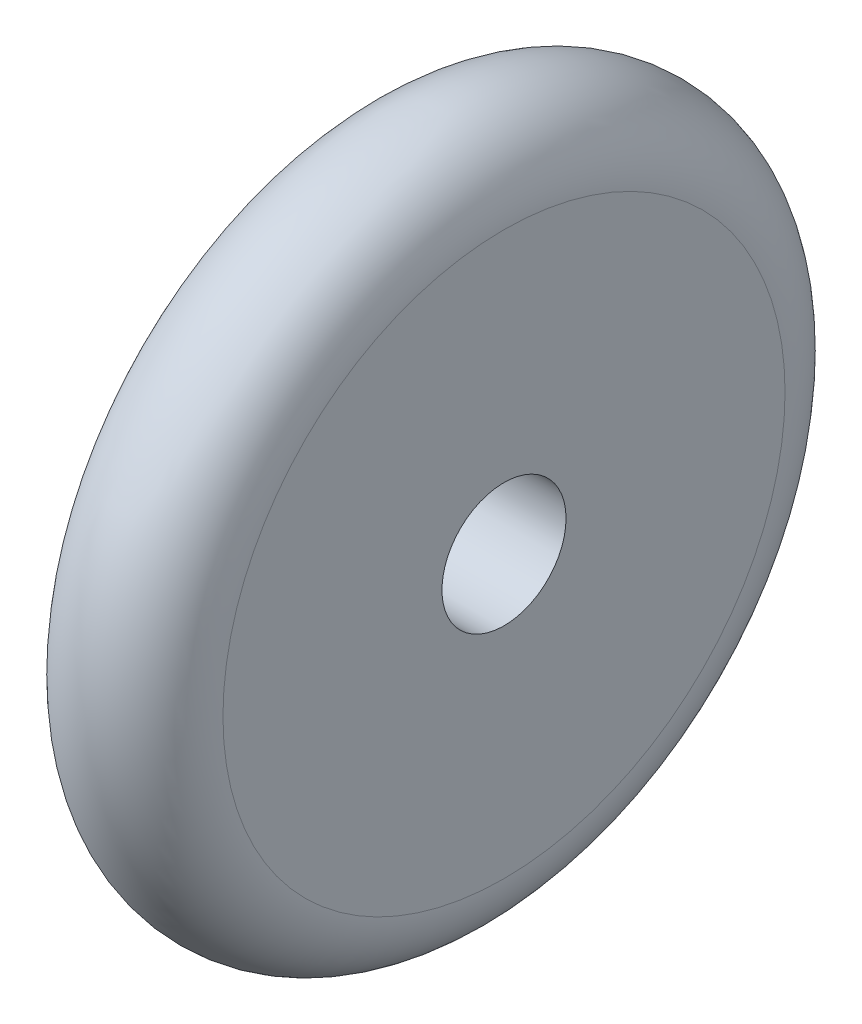
ISO-10303-21;
HEADER;
FILE_DESCRIPTION(('STEP AP214'),'2;1');
FILE_NAME('part.step','',(''),(''),'','','');
FILE_SCHEMA(('AUTOMOTIVE_DESIGN { 1 0 10303 214 1 1 1 1 }'));
ENDSEC;
DATA;
#1=APPLICATION_CONTEXT('core data for automotive mechanical design processes');
#2=APPLICATION_PROTOCOL_DEFINITION('international standard','automotive_design',2000,#1);
#3=PRODUCT_CONTEXT('',#1,'mechanical');
#4=PRODUCT('Part','Part','',(#3));
#5=PRODUCT_RELATED_PRODUCT_CATEGORY('part','',(#4));
#6=PRODUCT_DEFINITION_FORMATION('','',#4);
#7=PRODUCT_DEFINITION_CONTEXT('part definition',#1,'design');
#8=PRODUCT_DEFINITION('design','',#6,#7);
#9=PRODUCT_DEFINITION_SHAPE('','',#8);
#10=(LENGTH_UNIT() NAMED_UNIT(*) SI_UNIT(.MILLI.,.METRE.));
#11=(NAMED_UNIT(*) PLANE_ANGLE_UNIT() SI_UNIT($,.RADIAN.));
#12=(NAMED_UNIT(*) SI_UNIT($,.STERADIAN.) SOLID_ANGLE_UNIT());
#13=UNCERTAINTY_MEASURE_WITH_UNIT(LENGTH_MEASURE(1.E-05),#10,'distance_accuracy_value','');
#14=(GEOMETRIC_REPRESENTATION_CONTEXT(3) GLOBAL_UNCERTAINTY_ASSIGNED_CONTEXT((#13)) GLOBAL_UNIT_ASSIGNED_CONTEXT((#10,
#11,#12)) REPRESENTATION_CONTEXT('',''));
#15=CARTESIAN_POINT('',(0.,0.,0.));
#16=DIRECTION('',(0.,0.,1.));
#17=DIRECTION('',(1.,0.,0.));
#18=AXIS2_PLACEMENT_3D('',#15,#16,#17);
#19=CARTESIAN_POINT('',(4.,-1.7,0.));
#20=DIRECTION('',(1.,0.,0.));
#21=DIRECTION('',(0.,0.,-1.));
#22=AXIS2_PLACEMENT_3D('',#19,#20,#21);
#23=CYLINDRICAL_SURFACE('',#22,1.7);
#24=CARTESIAN_POINT('',(4.,-1.7,0.));
#25=DIRECTION('',(1.,0.,0.));
#26=DIRECTION('',(0.,0.,-1.));
#27=AXIS2_PLACEMENT_3D('',#24,#25,#26);
#28=CIRCLE('',#27,1.7);
#29=CARTESIAN_POINT('',(4.,-1.7,-1.7));
#30=VERTEX_POINT('',#29);
#31=EDGE_CURVE('E10',#30,#30,#28,.T.);
#32=ORIENTED_EDGE('',*,*,#31,.T.);
#33=EDGE_LOOP('',(#32));
#34=FACE_BOUND('',#33,.T.);
#35=CARTESIAN_POINT('',(0.,-1.7,0.));
#36=DIRECTION('',(1.,0.,0.));
#37=DIRECTION('',(0.,0.,-1.));
#38=AXIS2_PLACEMENT_3D('',#35,#36,#37);
#39=CIRCLE('',#38,1.7);
#40=CARTESIAN_POINT('',(0.,-1.7,-1.7));
#41=VERTEX_POINT('',#40);
#42=EDGE_CURVE('E56',#41,#41,#39,.T.);
#43=ORIENTED_EDGE('',*,*,#42,.F.);
#44=EDGE_LOOP('',(#43));
#45=FACE_BOUND('',#44,.T.);
#46=ADVANCED_FACE('F39',(#34,#45),#23,.F.);
#47=CARTESIAN_POINT('',(4.,0.,0.));
#48=DIRECTION('',(1.,0.,0.));
#49=DIRECTION('',(0.,0.,-1.));
#50=AXIS2_PLACEMENT_3D('',#47,#48,#49);
#51=PLANE('',#50);
#52=CARTESIAN_POINT('',(4.,-1.7,0.));
#53=DIRECTION('',(1.,0.,0.));
#54=DIRECTION('',(0.,0.,-1.));
#55=AXIS2_PLACEMENT_3D('',#52,#53,#54);
#56=CIRCLE('',#55,7.7);
#57=CARTESIAN_POINT('',(4.,-1.7,-7.7));
#58=VERTEX_POINT('',#57);
#59=EDGE_CURVE('E46',#58,#58,#56,.T.);
#60=ORIENTED_EDGE('',*,*,#59,.T.);
#61=EDGE_LOOP('',(#60));
#62=FACE_BOUND('',#61,.T.);
#63=ORIENTED_EDGE('',*,*,#31,.F.);
#64=EDGE_LOOP('',(#63));
#65=FACE_BOUND('',#64,.T.);
#66=ADVANCED_FACE('F66',(#62,#65),#51,.T.);
#67=CARTESIAN_POINT('',(2.,-1.7,0.));
#68=DIRECTION('',(1.,0.,0.));
#69=DIRECTION('',(0.,0.,-1.));
#70=AXIS2_PLACEMENT_3D('',#67,#68,#69);
#71=TOROIDAL_SURFACE('',#70,7.7,2.);
#72=ORIENTED_EDGE('',*,*,#59,.F.);
#73=EDGE_LOOP('',(#72));
#74=FACE_BOUND('',#73,.T.);
#75=CARTESIAN_POINT('',(0.,-1.7,0.));
#76=DIRECTION('',(1.,0.,0.));
#77=DIRECTION('',(0.,0.,-1.));
#78=AXIS2_PLACEMENT_3D('',#75,#76,#77);
#79=CIRCLE('',#78,7.7);
#80=CARTESIAN_POINT('',(0.,-1.7,-7.7));
#81=VERTEX_POINT('',#80);
#82=EDGE_CURVE('E51',#81,#81,#79,.T.);
#83=ORIENTED_EDGE('',*,*,#82,.T.);
#84=EDGE_LOOP('',(#83));
#85=FACE_BOUND('',#84,.T.);
#86=ADVANCED_FACE('F70',(#74,#85),#71,.T.);
#87=CARTESIAN_POINT('',(0.,0.,0.));
#88=DIRECTION('',(1.,0.,0.));
#89=DIRECTION('',(0.,0.,-1.));
#90=AXIS2_PLACEMENT_3D('',#87,#88,#89);
#91=PLANE('',#90);
#92=ORIENTED_EDGE('',*,*,#82,.F.);
#93=EDGE_LOOP('',(#92));
#94=FACE_BOUND('',#93,.T.);
#95=ORIENTED_EDGE('',*,*,#42,.T.);
#96=EDGE_LOOP('',(#95));
#97=FACE_BOUND('',#96,.T.);
#98=ADVANCED_FACE('F63',(#94,#97),#91,.F.);
#99=CLOSED_SHELL('',(#46,#66,#86,#98));
#100=MANIFOLD_SOLID_BREP('B2',#99);
#101=ADVANCED_BREP_SHAPE_REPRESENTATION('',(#18,#100),#14);
#102=SHAPE_DEFINITION_REPRESENTATION(#9,#101);
ENDSEC;
END-ISO-10303-21;
